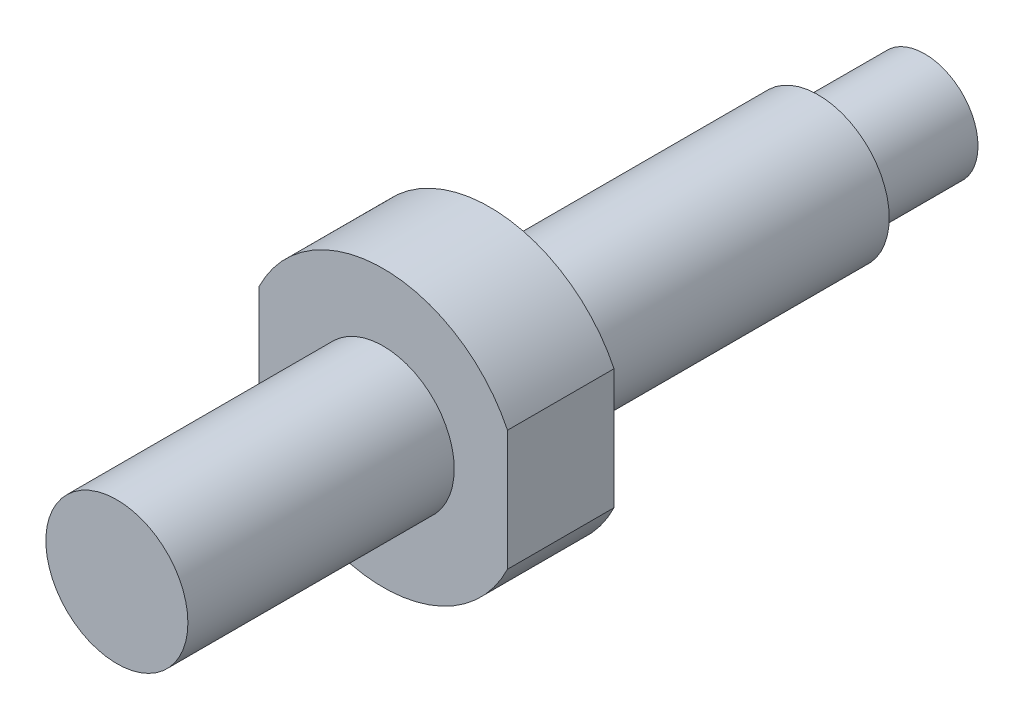
ISO-10303-21;
HEADER;
FILE_DESCRIPTION(('STEP AP214'),'2;1');
FILE_NAME('part.step','',(''),(''),'','','');
FILE_SCHEMA(('AUTOMOTIVE_DESIGN { 1 0 10303 214 1 1 1 1 }'));
ENDSEC;
DATA;
#1=APPLICATION_CONTEXT('core data for automotive mechanical design processes');
#2=APPLICATION_PROTOCOL_DEFINITION('international standard','automotive_design',2000,#1);
#3=PRODUCT_CONTEXT('',#1,'mechanical');
#4=PRODUCT('Part','Part','',(#3));
#5=PRODUCT_RELATED_PRODUCT_CATEGORY('part','',(#4));
#6=PRODUCT_DEFINITION_FORMATION('','',#4);
#7=PRODUCT_DEFINITION_CONTEXT('part definition',#1,'design');
#8=PRODUCT_DEFINITION('design','',#6,#7);
#9=PRODUCT_DEFINITION_SHAPE('','',#8);
#10=(LENGTH_UNIT() NAMED_UNIT(*) SI_UNIT(.MILLI.,.METRE.));
#11=(NAMED_UNIT(*) PLANE_ANGLE_UNIT() SI_UNIT($,.RADIAN.));
#12=(NAMED_UNIT(*) SI_UNIT($,.STERADIAN.) SOLID_ANGLE_UNIT());
#13=UNCERTAINTY_MEASURE_WITH_UNIT(LENGTH_MEASURE(1.E-05),#10,'distance_accuracy_value','');
#14=(GEOMETRIC_REPRESENTATION_CONTEXT(3) GLOBAL_UNCERTAINTY_ASSIGNED_CONTEXT((#13)) GLOBAL_UNIT_ASSIGNED_CONTEXT((#10,
#11,#12)) REPRESENTATION_CONTEXT('',''));
#15=CARTESIAN_POINT('',(0.,0.,0.));
#16=DIRECTION('',(0.,0.,1.));
#17=DIRECTION('',(1.,0.,0.));
#18=AXIS2_PLACEMENT_3D('',#15,#16,#17);
#19=CARTESIAN_POINT('',(0.,4.,-39.5));
#20=DIRECTION('',(0.,0.,1.));
#21=DIRECTION('',(1.,0.,0.));
#22=AXIS2_PLACEMENT_3D('',#19,#20,#21);
#23=PLANE('',#22);
#24=CARTESIAN_POINT('',(0.,0.,-39.5));
#25=DIRECTION('',(0.,0.,1.));
#26=DIRECTION('',(1.,0.,0.));
#27=AXIS2_PLACEMENT_3D('',#24,#25,#26);
#28=CIRCLE('',#27,4.);
#29=CARTESIAN_POINT('',(4.,0.,-39.5));
#30=VERTEX_POINT('',#29);
#31=EDGE_CURVE('E126',#30,#30,#28,.T.);
#32=ORIENTED_EDGE('',*,*,#31,.F.);
#33=EDGE_LOOP('',(#32));
#34=FACE_BOUND('',#33,.T.);
#35=CARTESIAN_POINT('',(0.,0.,-39.5));
#36=DIRECTION('',(0.,0.,1.));
#37=DIRECTION('',(1.,0.,0.));
#38=AXIS2_PLACEMENT_3D('',#35,#36,#37);
#39=CIRCLE('',#38,3.);
#40=CARTESIAN_POINT('',(3.,0.,-39.5));
#41=VERTEX_POINT('',#40);
#42=EDGE_CURVE('E12',#41,#41,#39,.F.);
#43=ORIENTED_EDGE('',*,*,#42,.F.);
#44=EDGE_LOOP('',(#43));
#45=FACE_BOUND('',#44,.T.);
#46=ADVANCED_FACE('F41',(#34,#45),#23,.F.);
#47=CARTESIAN_POINT('',(0.,4.,-15.));
#48=DIRECTION('',(0.,0.,-1.));
#49=DIRECTION('',(-1.,0.,0.));
#50=AXIS2_PLACEMENT_3D('',#47,#48,#49);
#51=PLANE('',#50);
#52=CARTESIAN_POINT('',(0.,0.,-15.));
#53=DIRECTION('',(0.,0.,1.));
#54=DIRECTION('',(1.,0.,0.));
#55=AXIS2_PLACEMENT_3D('',#52,#53,#54);
#56=CIRCLE('',#55,4.);
#57=CARTESIAN_POINT('',(4.,0.,-15.));
#58=VERTEX_POINT('',#57);
#59=EDGE_CURVE('E107',#58,#58,#56,.T.);
#60=ORIENTED_EDGE('',*,*,#59,.F.);
#61=EDGE_LOOP('',(#60));
#62=FACE_BOUND('',#61,.T.);
#63=CARTESIAN_POINT('',(0.,0.,-15.));
#64=DIRECTION('',(0.,0.,-1.));
#65=DIRECTION('',(-1.,0.,0.));
#66=AXIS2_PLACEMENT_3D('',#63,#64,#65);
#67=CIRCLE('',#66,7.77784742024014);
#68=CARTESIAN_POINT('',(-7.,3.39041450158181,-15.));
#69=VERTEX_POINT('',#68);
#70=CARTESIAN_POINT('',(7.,3.39041450158181,-15.));
#71=VERTEX_POINT('',#70);
#72=EDGE_CURVE('E83',#69,#71,#67,.T.);
#73=ORIENTED_EDGE('',*,*,#72,.F.);
#74=DIRECTION('',(0.,1.,0.));
#75=VECTOR('',#74,1.);
#76=CARTESIAN_POINT('',(-7.,-8.43799237337698,-15.));
#77=LINE('',#76,#75);
#78=CARTESIAN_POINT('',(-7.,-3.39041450158181,-15.));
#79=VERTEX_POINT('',#78);
#80=EDGE_CURVE('E117',#79,#69,#77,.T.);
#81=ORIENTED_EDGE('',*,*,#80,.F.);
#82=CARTESIAN_POINT('',(7.,-3.39041450158181,-15.));
#83=VERTEX_POINT('',#82);
#84=EDGE_CURVE('E56',#83,#79,#67,.T.);
#85=ORIENTED_EDGE('',*,*,#84,.F.);
#86=DIRECTION('',(0.,-1.,0.));
#87=VECTOR('',#86,1.);
#88=CARTESIAN_POINT('',(7.,-8.43799237337698,-15.));
#89=LINE('',#88,#87);
#90=EDGE_CURVE('E120',#71,#83,#89,.T.);
#91=ORIENTED_EDGE('',*,*,#90,.F.);
#92=EDGE_LOOP('',(#73,#81,#85,#91));
#93=FACE_BOUND('',#92,.T.);
#94=ADVANCED_FACE('F119',(#62,#93),#51,.F.);
#95=CARTESIAN_POINT('',(0.,9.,-21.));
#96=DIRECTION('',(0.,0.,1.));
#97=DIRECTION('',(1.,0.,0.));
#98=AXIS2_PLACEMENT_3D('',#95,#96,#97);
#99=PLANE('',#98);
#100=CARTESIAN_POINT('',(0.,0.,-21.));
#101=DIRECTION('',(0.,0.,1.));
#102=DIRECTION('',(1.,0.,0.));
#103=AXIS2_PLACEMENT_3D('',#100,#101,#102);
#104=CIRCLE('',#103,4.);
#105=CARTESIAN_POINT('',(4.,0.,-21.));
#106=VERTEX_POINT('',#105);
#107=EDGE_CURVE('E129',#106,#106,#104,.T.);
#108=ORIENTED_EDGE('',*,*,#107,.T.);
#109=EDGE_LOOP('',(#108));
#110=FACE_BOUND('',#109,.T.);
#111=CARTESIAN_POINT('',(0.,0.,-21.));
#112=DIRECTION('',(0.,0.,-1.));
#113=DIRECTION('',(-1.,0.,0.));
#114=AXIS2_PLACEMENT_3D('',#111,#112,#113);
#115=CIRCLE('',#114,7.77784742024014);
#116=CARTESIAN_POINT('',(-7.,3.39041450158181,-21.));
#117=VERTEX_POINT('',#116);
#118=CARTESIAN_POINT('',(7.,3.39041450158181,-21.));
#119=VERTEX_POINT('',#118);
#120=EDGE_CURVE('E64',#117,#119,#115,.T.);
#121=ORIENTED_EDGE('',*,*,#120,.T.);
#122=DIRECTION('',(0.,-1.,0.));
#123=VECTOR('',#122,1.);
#124=CARTESIAN_POINT('',(7.,9.,-21.));
#125=LINE('',#124,#123);
#126=CARTESIAN_POINT('',(7.,-3.39041450158181,-21.));
#127=VERTEX_POINT('',#126);
#128=EDGE_CURVE('E94',#119,#127,#125,.T.);
#129=ORIENTED_EDGE('',*,*,#128,.T.);
#130=CARTESIAN_POINT('',(-7.,-3.39041450158181,-21.));
#131=VERTEX_POINT('',#130);
#132=EDGE_CURVE('E97',#127,#131,#115,.T.);
#133=ORIENTED_EDGE('',*,*,#132,.T.);
#134=DIRECTION('',(0.,1.,0.));
#135=VECTOR('',#134,1.);
#136=CARTESIAN_POINT('',(-7.,9.,-21.));
#137=LINE('',#136,#135);
#138=EDGE_CURVE('E96',#131,#117,#137,.T.);
#139=ORIENTED_EDGE('',*,*,#138,.T.);
#140=EDGE_LOOP('',(#121,#129,#133,#139));
#141=FACE_BOUND('',#140,.T.);
#142=ADVANCED_FACE('F92',(#110,#141),#99,.F.);
#143=CARTESIAN_POINT('',(7.,-8.43799237337698,-25.));
#144=DIRECTION('',(-1.,0.,0.));
#145=DIRECTION('',(0.,0.,1.));
#146=AXIS2_PLACEMENT_3D('',#143,#144,#145);
#147=PLANE('',#146);
#148=DIRECTION('',(0.,0.,-1.));
#149=VECTOR('',#148,1.);
#150=CARTESIAN_POINT('',(7.,3.39041450158181,-11.));
#151=LINE('',#150,#149);
#152=EDGE_CURVE('E80',#71,#119,#151,.T.);
#153=ORIENTED_EDGE('',*,*,#152,.F.);
#154=ORIENTED_EDGE('',*,*,#90,.T.);
#155=DIRECTION('',(0.,0.,-1.));
#156=VECTOR('',#155,1.);
#157=CARTESIAN_POINT('',(7.,-3.39041450158181,-11.));
#158=LINE('',#157,#156);
#159=EDGE_CURVE('E101',#127,#83,#158,.F.);
#160=ORIENTED_EDGE('',*,*,#159,.F.);
#161=ORIENTED_EDGE('',*,*,#128,.F.);
#162=EDGE_LOOP('',(#153,#154,#160,#161));
#163=FACE_BOUND('',#162,.T.);
#164=ADVANCED_FACE('F100',(#163),#147,.F.);
#165=CARTESIAN_POINT('',(-7.,-8.43799237337698,-25.));
#166=DIRECTION('',(1.,0.,0.));
#167=DIRECTION('',(0.,0.,-1.));
#168=AXIS2_PLACEMENT_3D('',#165,#166,#167);
#169=PLANE('',#168);
#170=DIRECTION('',(0.,0.,-1.));
#171=VECTOR('',#170,1.);
#172=CARTESIAN_POINT('',(-7.,-3.39041450158181,-11.));
#173=LINE('',#172,#171);
#174=EDGE_CURVE('E49',#79,#131,#173,.T.);
#175=ORIENTED_EDGE('',*,*,#174,.F.);
#176=ORIENTED_EDGE('',*,*,#80,.T.);
#177=DIRECTION('',(0.,0.,-1.));
#178=VECTOR('',#177,1.);
#179=CARTESIAN_POINT('',(-7.,3.39041450158181,-11.));
#180=LINE('',#179,#178);
#181=EDGE_CURVE('E104',#117,#69,#180,.F.);
#182=ORIENTED_EDGE('',*,*,#181,.F.);
#183=ORIENTED_EDGE('',*,*,#138,.F.);
#184=EDGE_LOOP('',(#175,#176,#182,#183));
#185=FACE_BOUND('',#184,.T.);
#186=ADVANCED_FACE('F116',(#185),#169,.F.);
#187=CARTESIAN_POINT('',(0.,0.,0.));
#188=DIRECTION('',(0.,0.,-1.));
#189=DIRECTION('',(-1.,0.,0.));
#190=AXIS2_PLACEMENT_3D('',#187,#188,#189);
#191=PLANE('',#190);
#192=CARTESIAN_POINT('',(0.,0.,0.));
#193=DIRECTION('',(0.,0.,1.));
#194=DIRECTION('',(1.,0.,0.));
#195=AXIS2_PLACEMENT_3D('',#192,#193,#194);
#196=CIRCLE('',#195,4.);
#197=CARTESIAN_POINT('',(4.,0.,0.));
#198=VERTEX_POINT('',#197);
#199=EDGE_CURVE('E102',#198,#198,#196,.T.);
#200=ORIENTED_EDGE('',*,*,#199,.T.);
#201=EDGE_LOOP('',(#200));
#202=FACE_BOUND('',#201,.T.);
#203=ADVANCED_FACE('F43',(#202),#191,.F.);
#204=CARTESIAN_POINT('',(0.,0.,0.));
#205=DIRECTION('',(0.,0.,1.));
#206=DIRECTION('',(1.,0.,0.));
#207=AXIS2_PLACEMENT_3D('',#204,#205,#206);
#208=CYLINDRICAL_SURFACE('',#207,4.);
#209=ORIENTED_EDGE('',*,*,#199,.F.);
#210=EDGE_LOOP('',(#209));
#211=FACE_BOUND('',#210,.T.);
#212=ORIENTED_EDGE('',*,*,#59,.T.);
#213=EDGE_LOOP('',(#212));
#214=FACE_BOUND('',#213,.T.);
#215=ADVANCED_FACE('F134',(#211,#214),#208,.T.);
#216=CARTESIAN_POINT('',(0.,0.,0.));
#217=DIRECTION('',(0.,0.,1.));
#218=DIRECTION('',(1.,0.,0.));
#219=AXIS2_PLACEMENT_3D('',#216,#217,#218);
#220=CYLINDRICAL_SURFACE('',#219,4.);
#221=ORIENTED_EDGE('',*,*,#107,.F.);
#222=EDGE_LOOP('',(#221));
#223=FACE_BOUND('',#222,.T.);
#224=ORIENTED_EDGE('',*,*,#31,.T.);
#225=EDGE_LOOP('',(#224));
#226=FACE_BOUND('',#225,.T.);
#227=ADVANCED_FACE('F148',(#223,#226),#220,.T.);
#228=CARTESIAN_POINT('',(0.,0.,-11.));
#229=DIRECTION('',(0.,0.,-1.));
#230=DIRECTION('',(-1.,0.,0.));
#231=AXIS2_PLACEMENT_3D('',#228,#229,#230);
#232=CYLINDRICAL_SURFACE('',#231,7.77784742024014);
#233=ORIENTED_EDGE('',*,*,#152,.T.);
#234=ORIENTED_EDGE('',*,*,#120,.F.);
#235=ORIENTED_EDGE('',*,*,#181,.T.);
#236=ORIENTED_EDGE('',*,*,#72,.T.);
#237=EDGE_LOOP('',(#233,#234,#235,#236));
#238=FACE_BOUND('',#237,.T.);
#239=ADVANCED_FACE('F81',(#238),#232,.T.);
#240=ORIENTED_EDGE('',*,*,#159,.T.);
#241=ORIENTED_EDGE('',*,*,#84,.T.);
#242=ORIENTED_EDGE('',*,*,#174,.T.);
#243=ORIENTED_EDGE('',*,*,#132,.F.);
#244=EDGE_LOOP('',(#240,#241,#242,#243));
#245=FACE_BOUND('',#244,.T.);
#246=ADVANCED_FACE('F111',(#245),#232,.T.);
#247=CARTESIAN_POINT('',(0.,0.,-45.5));
#248=DIRECTION('',(0.,0.,1.));
#249=DIRECTION('',(1.,0.,0.));
#250=AXIS2_PLACEMENT_3D('',#247,#248,#249);
#251=CYLINDRICAL_SURFACE('',#250,3.);
#252=CARTESIAN_POINT('',(0.,0.,-45.5));
#253=DIRECTION('',(0.,0.,-1.));
#254=DIRECTION('',(-1.,0.,0.));
#255=AXIS2_PLACEMENT_3D('',#252,#253,#254);
#256=CIRCLE('',#255,3.);
#257=CARTESIAN_POINT('',(-3.,0.,-45.5));
#258=VERTEX_POINT('',#257);
#259=EDGE_CURVE('E115',#258,#258,#256,.T.);
#260=ORIENTED_EDGE('',*,*,#259,.F.);
#261=EDGE_LOOP('',(#260));
#262=FACE_BOUND('',#261,.T.);
#263=ORIENTED_EDGE('',*,*,#42,.T.);
#264=EDGE_LOOP('',(#263));
#265=FACE_BOUND('',#264,.T.);
#266=ADVANCED_FACE('F168',(#262,#265),#251,.T.);
#267=CARTESIAN_POINT('',(0.,0.,-45.5));
#268=DIRECTION('',(0.,0.,-1.));
#269=DIRECTION('',(-1.,0.,0.));
#270=AXIS2_PLACEMENT_3D('',#267,#268,#269);
#271=PLANE('',#270);
#272=ORIENTED_EDGE('',*,*,#259,.T.);
#273=EDGE_LOOP('',(#272));
#274=FACE_BOUND('',#273,.T.);
#275=ADVANCED_FACE('F171',(#274),#271,.T.);
#276=CLOSED_SHELL('',(#46,#94,#142,#164,#186,#203,#215,#227,#239,#246,#266,#275));
#277=MANIFOLD_SOLID_BREP('B2',#276);
#278=ADVANCED_BREP_SHAPE_REPRESENTATION('',(#18,#277),#14);
#279=SHAPE_DEFINITION_REPRESENTATION(#9,#278);
ENDSEC;
END-ISO-10303-21;
